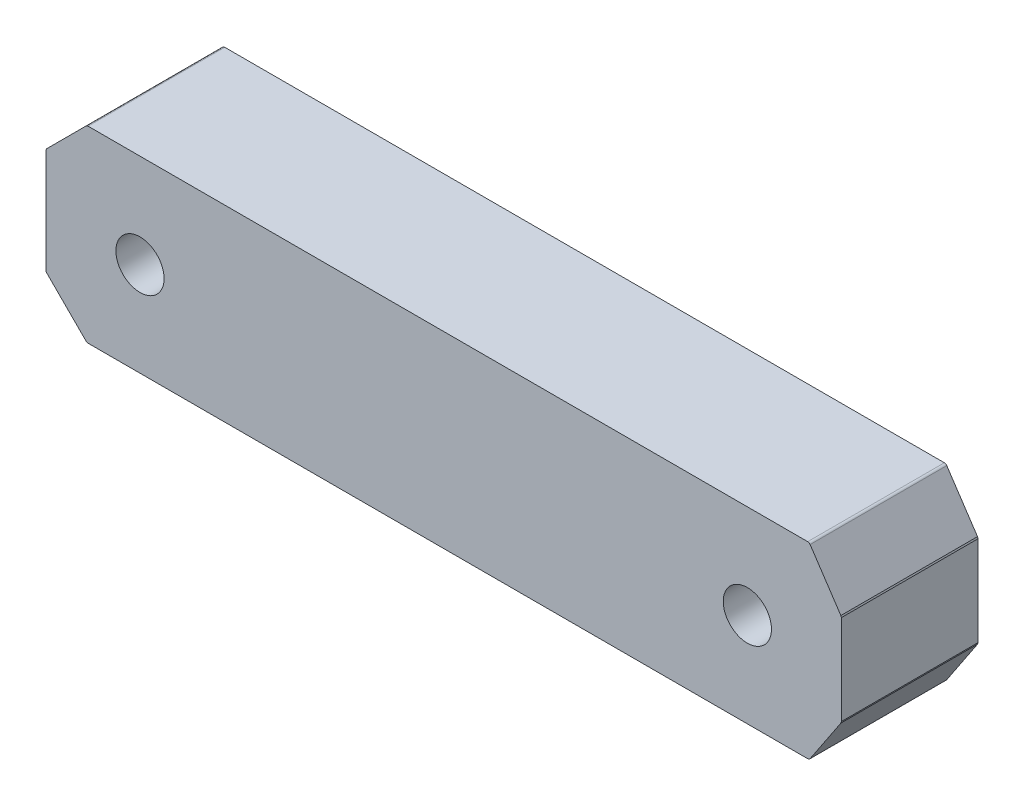
ISO-10303-21;
HEADER;
FILE_DESCRIPTION(('STEP AP214'),'2;1');
FILE_NAME('part.step','',(''),(''),'','','');
FILE_SCHEMA(('AUTOMOTIVE_DESIGN { 1 0 10303 214 1 1 1 1 }'));
ENDSEC;
DATA;
#1=APPLICATION_CONTEXT('core data for automotive mechanical design processes');
#2=APPLICATION_PROTOCOL_DEFINITION('international standard','automotive_design',2000,#1);
#3=PRODUCT_CONTEXT('',#1,'mechanical');
#4=PRODUCT('Part','Part','',(#3));
#5=PRODUCT_RELATED_PRODUCT_CATEGORY('part','',(#4));
#6=PRODUCT_DEFINITION_FORMATION('','',#4);
#7=PRODUCT_DEFINITION_CONTEXT('part definition',#1,'design');
#8=PRODUCT_DEFINITION('design','',#6,#7);
#9=PRODUCT_DEFINITION_SHAPE('','',#8);
#10=(LENGTH_UNIT() NAMED_UNIT(*) SI_UNIT(.MILLI.,.METRE.));
#11=(NAMED_UNIT(*) PLANE_ANGLE_UNIT() SI_UNIT($,.RADIAN.));
#12=(NAMED_UNIT(*) SI_UNIT($,.STERADIAN.) SOLID_ANGLE_UNIT());
#13=UNCERTAINTY_MEASURE_WITH_UNIT(LENGTH_MEASURE(1.E-05),#10,'distance_accuracy_value','');
#14=(GEOMETRIC_REPRESENTATION_CONTEXT(3) GLOBAL_UNCERTAINTY_ASSIGNED_CONTEXT((#13)) GLOBAL_UNIT_ASSIGNED_CONTEXT((#10,
#11,#12)) REPRESENTATION_CONTEXT('',''));
#15=CARTESIAN_POINT('',(0.,0.,0.));
#16=DIRECTION('',(0.,0.,1.));
#17=DIRECTION('',(1.,0.,0.));
#18=AXIS2_PLACEMENT_3D('',#15,#16,#17);
#19=CARTESIAN_POINT('',(-24.588730162779,-6.3,9.45));
#20=DIRECTION('',(0.,0.,1.));
#21=DIRECTION('',(1.,0.,0.));
#22=AXIS2_PLACEMENT_3D('',#19,#20,#21);
#23=PLANE('',#22);
#24=CARTESIAN_POINT('',(20.9999999999963,1.68441649517348E-12,9.45));
#25=DIRECTION('',(0.,0.,1.));
#26=DIRECTION('',(1.,0.,0.));
#27=AXIS2_PLACEMENT_3D('',#24,#25,#26);
#28=CIRCLE('',#27,1.666);
#29=CARTESIAN_POINT('',(22.6659999999963,1.68441649517348E-12,9.45));
#30=VERTEX_POINT('',#29);
#31=EDGE_CURVE('E182',#30,#30,#28,.T.);
#32=ORIENTED_EDGE('',*,*,#31,.F.);
#33=EDGE_LOOP('',(#32));
#34=FACE_BOUND('',#33,.T.);
#35=CARTESIAN_POINT('',(-24.588730162779,-6.3,9.45));
#36=DIRECTION('',(0.,0.,1.));
#37=DIRECTION('',(1.,0.,0.));
#38=AXIS2_PLACEMENT_3D('',#35,#36,#37);
#39=CIRCLE('',#38,0.200000000000001);
#40=CARTESIAN_POINT('',(-24.7301515190163,-6.44142135623731,9.45));
#41=VERTEX_POINT('',#40);
#42=CARTESIAN_POINT('',(-24.588730162779,-6.5,9.45));
#43=VERTEX_POINT('',#42);
#44=EDGE_CURVE('E209',#41,#43,#39,.T.);
#45=ORIENTED_EDGE('',*,*,#44,.T.);
#46=DIRECTION('',(1.,0.,0.));
#47=VECTOR('',#46,1.);
#48=CARTESIAN_POINT('',(-24.588730162779,-6.5,9.45));
#49=LINE('',#48,#47);
#50=CARTESIAN_POINT('',(25.174488320499,-6.5,9.45));
#51=VERTEX_POINT('',#50);
#52=EDGE_CURVE('E117',#43,#51,#49,.T.);
#53=ORIENTED_EDGE('',*,*,#52,.T.);
#54=CARTESIAN_POINT('',(25.174488320499,-6.3,9.45));
#55=DIRECTION('',(0.,0.,1.));
#56=DIRECTION('',(1.,0.,0.));
#57=AXIS2_PLACEMENT_3D('',#54,#55,#56);
#58=CIRCLE('',#57,0.2);
#59=CARTESIAN_POINT('',(25.3409096767364,-6.41092309132067,9.45));
#60=VERTEX_POINT('',#59);
#61=EDGE_CURVE('E248',#51,#60,#58,.T.);
#62=ORIENTED_EDGE('',*,*,#61,.T.);
#63=DIRECTION('',(0.554615456603367,0.832106781186549,0.));
#64=VECTOR('',#63,1.);
#65=CARTESIAN_POINT('',(27.4664213562376,-3.22195195655296,9.45));
#66=LINE('',#65,#64);
#67=CARTESIAN_POINT('',(27.4664213562376,-3.22195195655296,9.45));
#68=VERTEX_POINT('',#67);
#69=EDGE_CURVE('E267',#60,#68,#66,.T.);
#70=ORIENTED_EDGE('',*,*,#69,.T.);
#71=DIRECTION('',(0.289735412759155,0.957106781186552,0.));
#72=VECTOR('',#71,1.);
#73=CARTESIAN_POINT('',(27.4664213562376,-3.22195195655296,9.45));
#74=LINE('',#73,#72);
#75=CARTESIAN_POINT('',(27.5000000000002,-3.11102886523228,9.45));
#76=VERTEX_POINT('',#75);
#77=EDGE_CURVE('E264',#68,#76,#74,.T.);
#78=ORIENTED_EDGE('',*,*,#77,.T.);
#79=DIRECTION('',(0.,1.,0.));
#80=VECTOR('',#79,1.);
#81=CARTESIAN_POINT('',(27.5000000000002,3.11102886523228,9.45));
#82=LINE('',#81,#80);
#83=CARTESIAN_POINT('',(27.5000000000002,3.11102886523228,9.45));
#84=VERTEX_POINT('',#83);
#85=EDGE_CURVE('E266',#76,#84,#82,.T.);
#86=ORIENTED_EDGE('',*,*,#85,.T.);
#87=DIRECTION('',(-0.289735412759156,0.957106781186551,0.));
#88=VECTOR('',#87,1.);
#89=CARTESIAN_POINT('',(27.5000000000002,3.11102886523228,9.45));
#90=LINE('',#89,#88);
#91=CARTESIAN_POINT('',(27.4664213562376,3.22195195655296,9.45));
#92=VERTEX_POINT('',#91);
#93=EDGE_CURVE('E269',#84,#92,#90,.T.);
#94=ORIENTED_EDGE('',*,*,#93,.T.);
#95=DIRECTION('',(-0.554615456603367,0.832106781186549,0.));
#96=VECTOR('',#95,1.);
#97=CARTESIAN_POINT('',(25.3409096767364,6.41092309132067,9.45));
#98=LINE('',#97,#96);
#99=CARTESIAN_POINT('',(25.3409096767364,6.41092309132067,9.45));
#100=VERTEX_POINT('',#99);
#101=EDGE_CURVE('E275',#92,#100,#98,.T.);
#102=ORIENTED_EDGE('',*,*,#101,.T.);
#103=CARTESIAN_POINT('',(25.174488320499,6.3,9.45));
#104=DIRECTION('',(0.,0.,1.));
#105=DIRECTION('',(1.,0.,0.));
#106=AXIS2_PLACEMENT_3D('',#103,#104,#105);
#107=CIRCLE('',#106,0.2);
#108=CARTESIAN_POINT('',(25.174488320499,6.5,9.45));
#109=VERTEX_POINT('',#108);
#110=EDGE_CURVE('E277',#100,#109,#107,.T.);
#111=ORIENTED_EDGE('',*,*,#110,.T.);
#112=DIRECTION('',(-1.,0.,0.));
#113=VECTOR('',#112,1.);
#114=CARTESIAN_POINT('',(25.174488320499,6.5,9.45));
#115=LINE('',#114,#113);
#116=CARTESIAN_POINT('',(-24.588730162779,6.5,9.45));
#117=VERTEX_POINT('',#116);
#118=EDGE_CURVE('E279',#109,#117,#115,.T.);
#119=ORIENTED_EDGE('',*,*,#118,.T.);
#120=CARTESIAN_POINT('',(-24.588730162779,6.3,9.45));
#121=DIRECTION('',(0.,0.,1.));
#122=DIRECTION('',(1.,0.,0.));
#123=AXIS2_PLACEMENT_3D('',#120,#121,#122);
#124=CIRCLE('',#123,0.2);
#125=CARTESIAN_POINT('',(-24.7301515190163,6.44142135623731,9.45));
#126=VERTEX_POINT('',#125);
#127=EDGE_CURVE('E281',#117,#126,#124,.T.);
#128=ORIENTED_EDGE('',*,*,#127,.T.);
#129=DIRECTION('',(-0.707106781186545,-0.70710678118655,0.));
#130=VECTOR('',#129,1.);
#131=CARTESIAN_POINT('',(-27.4414213562371,3.73015151901648,9.45));
#132=LINE('',#131,#130);
#133=CARTESIAN_POINT('',(-27.4414213562371,3.73015151901648,9.45));
#134=VERTEX_POINT('',#133);
#135=EDGE_CURVE('E283',#126,#134,#132,.T.);
#136=ORIENTED_EDGE('',*,*,#135,.T.);
#137=CARTESIAN_POINT('',(-27.2999999999998,3.58873016277918,9.45));
#138=DIRECTION('',(0.,0.,1.));
#139=DIRECTION('',(1.,0.,0.));
#140=AXIS2_PLACEMENT_3D('',#137,#138,#139);
#141=CIRCLE('',#140,0.199999999999999);
#142=CARTESIAN_POINT('',(-27.4999999999998,3.58873016277918,9.45));
#143=VERTEX_POINT('',#142);
#144=EDGE_CURVE('E160',#134,#143,#141,.T.);
#145=ORIENTED_EDGE('',*,*,#144,.T.);
#146=DIRECTION('',(0.,-1.,0.));
#147=VECTOR('',#146,1.);
#148=CARTESIAN_POINT('',(-27.4999999999998,-3.58873016277918,9.45));
#149=LINE('',#148,#147);
#150=CARTESIAN_POINT('',(-27.4999999999998,-3.58873016277918,9.45));
#151=VERTEX_POINT('',#150);
#152=EDGE_CURVE('E154',#143,#151,#149,.T.);
#153=ORIENTED_EDGE('',*,*,#152,.T.);
#154=CARTESIAN_POINT('',(-27.2999999999998,-3.58873016277918,9.45));
#155=DIRECTION('',(0.,0.,1.));
#156=DIRECTION('',(1.,0.,0.));
#157=AXIS2_PLACEMENT_3D('',#154,#155,#156);
#158=CIRCLE('',#157,0.199999999999999);
#159=CARTESIAN_POINT('',(-27.4414213562371,-3.73015151901649,9.45));
#160=VERTEX_POINT('',#159);
#161=EDGE_CURVE('E158',#151,#160,#158,.T.);
#162=ORIENTED_EDGE('',*,*,#161,.T.);
#163=DIRECTION('',(0.707106781186545,-0.70710678118655,0.));
#164=VECTOR('',#163,1.);
#165=CARTESIAN_POINT('',(-24.7301515190163,-6.44142135623731,9.45));
#166=LINE('',#165,#164);
#167=EDGE_CURVE('E50',#160,#41,#166,.T.);
#168=ORIENTED_EDGE('',*,*,#167,.T.);
#169=EDGE_LOOP('',(#45,#53,#62,#70,#78,#86,#94,#102,#111,#119,#128,#136,#145,#153,#162,#168));
#170=FACE_BOUND('',#169,.T.);
#171=CARTESIAN_POINT('',(-21.0000000000037,1.18481613409216E-12,9.45));
#172=DIRECTION('',(0.,0.,1.));
#173=DIRECTION('',(1.,0.,0.));
#174=AXIS2_PLACEMENT_3D('',#171,#172,#173);
#175=CIRCLE('',#174,1.66600000000001);
#176=CARTESIAN_POINT('',(-19.3340000000037,1.18481613409216E-12,9.45));
#177=VERTEX_POINT('',#176);
#178=EDGE_CURVE('E325',#177,#177,#175,.T.);
#179=ORIENTED_EDGE('',*,*,#178,.F.);
#180=EDGE_LOOP('',(#179));
#181=FACE_BOUND('',#180,.T.);
#182=ADVANCED_FACE('F33',(#34,#170,#181),#23,.T.);
#183=CARTESIAN_POINT('',(-24.588730162779,-6.3,0.));
#184=DIRECTION('',(0.,0.,1.));
#185=DIRECTION('',(1.,0.,0.));
#186=AXIS2_PLACEMENT_3D('',#183,#184,#185);
#187=PLANE('',#186);
#188=CARTESIAN_POINT('',(-24.588730162779,-6.3,0.));
#189=DIRECTION('',(0.,0.,1.));
#190=DIRECTION('',(1.,0.,0.));
#191=AXIS2_PLACEMENT_3D('',#188,#189,#190);
#192=CIRCLE('',#191,0.200000000000001);
#193=CARTESIAN_POINT('',(-24.7301515190163,-6.44142135623731,0.));
#194=VERTEX_POINT('',#193);
#195=CARTESIAN_POINT('',(-24.588730162779,-6.5,0.));
#196=VERTEX_POINT('',#195);
#197=EDGE_CURVE('E178',#194,#196,#192,.T.);
#198=ORIENTED_EDGE('',*,*,#197,.F.);
#199=DIRECTION('',(0.707106781186545,-0.70710678118655,0.));
#200=VECTOR('',#199,1.);
#201=CARTESIAN_POINT('',(-24.7301515190163,-6.44142135623731,0.));
#202=LINE('',#201,#200);
#203=CARTESIAN_POINT('',(-27.4414213562371,-3.73015151901649,0.));
#204=VERTEX_POINT('',#203);
#205=EDGE_CURVE('E109',#204,#194,#202,.T.);
#206=ORIENTED_EDGE('',*,*,#205,.F.);
#207=CARTESIAN_POINT('',(-27.2999999999998,-3.58873016277918,0.));
#208=DIRECTION('',(0.,0.,1.));
#209=DIRECTION('',(1.,0.,0.));
#210=AXIS2_PLACEMENT_3D('',#207,#208,#209);
#211=CIRCLE('',#210,0.199999999999999);
#212=CARTESIAN_POINT('',(-27.4999999999998,-3.58873016277918,0.));
#213=VERTEX_POINT('',#212);
#214=EDGE_CURVE('E103',#213,#204,#211,.T.);
#215=ORIENTED_EDGE('',*,*,#214,.F.);
#216=DIRECTION('',(0.,-1.,0.));
#217=VECTOR('',#216,1.);
#218=CARTESIAN_POINT('',(-27.4999999999998,-3.58873016277918,0.));
#219=LINE('',#218,#217);
#220=CARTESIAN_POINT('',(-27.4999999999998,3.58873016277918,0.));
#221=VERTEX_POINT('',#220);
#222=EDGE_CURVE('E168',#221,#213,#219,.T.);
#223=ORIENTED_EDGE('',*,*,#222,.F.);
#224=CARTESIAN_POINT('',(-27.2999999999998,3.58873016277918,0.));
#225=DIRECTION('',(0.,0.,1.));
#226=DIRECTION('',(1.,0.,0.));
#227=AXIS2_PLACEMENT_3D('',#224,#225,#226);
#228=CIRCLE('',#227,0.199999999999999);
#229=CARTESIAN_POINT('',(-27.4414213562371,3.73015151901648,0.));
#230=VERTEX_POINT('',#229);
#231=EDGE_CURVE('E204',#230,#221,#228,.T.);
#232=ORIENTED_EDGE('',*,*,#231,.F.);
#233=DIRECTION('',(-0.707106781186545,-0.70710678118655,0.));
#234=VECTOR('',#233,1.);
#235=CARTESIAN_POINT('',(-27.4414213562371,3.73015151901648,0.));
#236=LINE('',#235,#234);
#237=CARTESIAN_POINT('',(-24.7301515190163,6.44142135623731,0.));
#238=VERTEX_POINT('',#237);
#239=EDGE_CURVE('E202',#238,#230,#236,.T.);
#240=ORIENTED_EDGE('',*,*,#239,.F.);
#241=CARTESIAN_POINT('',(-24.588730162779,6.3,0.));
#242=DIRECTION('',(0.,0.,1.));
#243=DIRECTION('',(1.,0.,0.));
#244=AXIS2_PLACEMENT_3D('',#241,#242,#243);
#245=CIRCLE('',#244,0.2);
#246=CARTESIAN_POINT('',(-24.588730162779,6.5,0.));
#247=VERTEX_POINT('',#246);
#248=EDGE_CURVE('E200',#247,#238,#245,.T.);
#249=ORIENTED_EDGE('',*,*,#248,.F.);
#250=DIRECTION('',(-1.,0.,0.));
#251=VECTOR('',#250,1.);
#252=CARTESIAN_POINT('',(25.174488320499,6.5,0.));
#253=LINE('',#252,#251);
#254=CARTESIAN_POINT('',(25.174488320499,6.5,0.));
#255=VERTEX_POINT('',#254);
#256=EDGE_CURVE('E198',#255,#247,#253,.T.);
#257=ORIENTED_EDGE('',*,*,#256,.F.);
#258=CARTESIAN_POINT('',(25.174488320499,6.3,0.));
#259=DIRECTION('',(0.,0.,1.));
#260=DIRECTION('',(1.,0.,0.));
#261=AXIS2_PLACEMENT_3D('',#258,#259,#260);
#262=CIRCLE('',#261,0.2);
#263=CARTESIAN_POINT('',(25.3409096767364,6.41092309132067,0.));
#264=VERTEX_POINT('',#263);
#265=EDGE_CURVE('E196',#264,#255,#262,.T.);
#266=ORIENTED_EDGE('',*,*,#265,.F.);
#267=DIRECTION('',(-0.554615456603367,0.832106781186549,0.));
#268=VECTOR('',#267,1.);
#269=CARTESIAN_POINT('',(25.3409096767364,6.41092309132067,0.));
#270=LINE('',#269,#268);
#271=CARTESIAN_POINT('',(27.4664213562376,3.22195195655296,0.));
#272=VERTEX_POINT('',#271);
#273=EDGE_CURVE('E194',#272,#264,#270,.T.);
#274=ORIENTED_EDGE('',*,*,#273,.F.);
#275=DIRECTION('',(-0.289735412759156,0.957106781186551,0.));
#276=VECTOR('',#275,1.);
#277=CARTESIAN_POINT('',(27.5000000000002,3.11102886523228,0.));
#278=LINE('',#277,#276);
#279=CARTESIAN_POINT('',(27.5000000000002,3.11102886523228,0.));
#280=VERTEX_POINT('',#279);
#281=EDGE_CURVE('E192',#280,#272,#278,.T.);
#282=ORIENTED_EDGE('',*,*,#281,.F.);
#283=DIRECTION('',(0.,1.,0.));
#284=VECTOR('',#283,1.);
#285=CARTESIAN_POINT('',(27.5000000000002,3.11102886523228,0.));
#286=LINE('',#285,#284);
#287=CARTESIAN_POINT('',(27.5000000000002,-3.11102886523228,0.));
#288=VERTEX_POINT('',#287);
#289=EDGE_CURVE('E190',#288,#280,#286,.T.);
#290=ORIENTED_EDGE('',*,*,#289,.F.);
#291=DIRECTION('',(0.289735412759155,0.957106781186552,0.));
#292=VECTOR('',#291,1.);
#293=CARTESIAN_POINT('',(27.4664213562376,-3.22195195655296,0.));
#294=LINE('',#293,#292);
#295=CARTESIAN_POINT('',(27.4664213562376,-3.22195195655296,0.));
#296=VERTEX_POINT('',#295);
#297=EDGE_CURVE('E188',#296,#288,#294,.T.);
#298=ORIENTED_EDGE('',*,*,#297,.F.);
#299=DIRECTION('',(0.554615456603367,0.832106781186549,0.));
#300=VECTOR('',#299,1.);
#301=CARTESIAN_POINT('',(27.4664213562376,-3.22195195655296,0.));
#302=LINE('',#301,#300);
#303=CARTESIAN_POINT('',(25.3409096767364,-6.41092309132067,0.));
#304=VERTEX_POINT('',#303);
#305=EDGE_CURVE('E186',#304,#296,#302,.T.);
#306=ORIENTED_EDGE('',*,*,#305,.F.);
#307=CARTESIAN_POINT('',(25.174488320499,-6.3,0.));
#308=DIRECTION('',(0.,0.,1.));
#309=DIRECTION('',(1.,0.,0.));
#310=AXIS2_PLACEMENT_3D('',#307,#308,#309);
#311=CIRCLE('',#310,0.2);
#312=CARTESIAN_POINT('',(25.174488320499,-6.5,0.));
#313=VERTEX_POINT('',#312);
#314=EDGE_CURVE('E184',#313,#304,#311,.T.);
#315=ORIENTED_EDGE('',*,*,#314,.F.);
#316=DIRECTION('',(1.,0.,0.));
#317=VECTOR('',#316,1.);
#318=CARTESIAN_POINT('',(-24.588730162779,-6.5,0.));
#319=LINE('',#318,#317);
#320=EDGE_CURVE('E181',#196,#313,#319,.T.);
#321=ORIENTED_EDGE('',*,*,#320,.F.);
#322=EDGE_LOOP('',(#198,#206,#215,#223,#232,#240,#249,#257,#266,#274,#282,#290,#298,#306,#315,#321));
#323=FACE_BOUND('',#322,.T.);
#324=CARTESIAN_POINT('',(20.9999999999963,1.68441649517348E-12,0.));
#325=DIRECTION('',(0.,0.,1.));
#326=DIRECTION('',(1.,0.,0.));
#327=AXIS2_PLACEMENT_3D('',#324,#325,#326);
#328=CIRCLE('',#327,1.666);
#329=CARTESIAN_POINT('',(22.6659999999963,1.68441649517348E-12,0.));
#330=VERTEX_POINT('',#329);
#331=EDGE_CURVE('E331',#330,#330,#328,.T.);
#332=ORIENTED_EDGE('',*,*,#331,.T.);
#333=EDGE_LOOP('',(#332));
#334=FACE_BOUND('',#333,.T.);
#335=CARTESIAN_POINT('',(-21.0000000000037,1.18481613409216E-12,0.));
#336=DIRECTION('',(0.,0.,1.));
#337=DIRECTION('',(1.,0.,0.));
#338=AXIS2_PLACEMENT_3D('',#335,#336,#337);
#339=CIRCLE('',#338,1.66600000000001);
#340=CARTESIAN_POINT('',(-19.3340000000037,1.18481613409216E-12,0.));
#341=VERTEX_POINT('',#340);
#342=EDGE_CURVE('E328',#341,#341,#339,.T.);
#343=ORIENTED_EDGE('',*,*,#342,.T.);
#344=EDGE_LOOP('',(#343));
#345=FACE_BOUND('',#344,.T.);
#346=ADVANCED_FACE('F252',(#323,#334,#345),#187,.F.);
#347=CARTESIAN_POINT('',(-24.588730162779,-6.3,9.45));
#348=DIRECTION('',(0.,0.,-1.));
#349=DIRECTION('',(-1.,0.,0.));
#350=AXIS2_PLACEMENT_3D('',#347,#348,#349);
#351=CYLINDRICAL_SURFACE('',#350,0.200000000000001);
#352=ORIENTED_EDGE('',*,*,#197,.T.);
#353=DIRECTION('',(0.,0.,-1.));
#354=VECTOR('',#353,1.);
#355=CARTESIAN_POINT('',(-24.588730162779,-6.5,9.45));
#356=LINE('',#355,#354);
#357=EDGE_CURVE('E11',#43,#196,#356,.T.);
#358=ORIENTED_EDGE('',*,*,#357,.F.);
#359=ORIENTED_EDGE('',*,*,#44,.F.);
#360=DIRECTION('',(0.,0.,-1.));
#361=VECTOR('',#360,1.);
#362=CARTESIAN_POINT('',(-24.7301515190163,-6.44142135623731,9.45));
#363=LINE('',#362,#361);
#364=EDGE_CURVE('E174',#41,#194,#363,.T.);
#365=ORIENTED_EDGE('',*,*,#364,.T.);
#366=EDGE_LOOP('',(#352,#358,#359,#365));
#367=FACE_BOUND('',#366,.T.);
#368=ADVANCED_FACE('F35',(#367),#351,.T.);
#369=CARTESIAN_POINT('',(-24.588730162779,-6.5,9.45));
#370=DIRECTION('',(0.,1.,0.));
#371=DIRECTION('',(0.,0.,1.));
#372=AXIS2_PLACEMENT_3D('',#369,#370,#371);
#373=PLANE('',#372);
#374=ORIENTED_EDGE('',*,*,#320,.T.);
#375=DIRECTION('',(0.,0.,-1.));
#376=VECTOR('',#375,1.);
#377=CARTESIAN_POINT('',(25.174488320499,-6.5,9.45));
#378=LINE('',#377,#376);
#379=EDGE_CURVE('E42',#51,#313,#378,.T.);
#380=ORIENTED_EDGE('',*,*,#379,.F.);
#381=ORIENTED_EDGE('',*,*,#52,.F.);
#382=ORIENTED_EDGE('',*,*,#357,.T.);
#383=EDGE_LOOP('',(#374,#380,#381,#382));
#384=FACE_BOUND('',#383,.T.);
#385=ADVANCED_FACE('F464',(#384),#373,.F.);
#386=CARTESIAN_POINT('',(25.174488320499,-6.3,9.45));
#387=DIRECTION('',(0.,0.,-1.));
#388=DIRECTION('',(-1.,0.,0.));
#389=AXIS2_PLACEMENT_3D('',#386,#387,#388);
#390=CYLINDRICAL_SURFACE('',#389,0.2);
#391=ORIENTED_EDGE('',*,*,#314,.T.);
#392=DIRECTION('',(0.,0.,-1.));
#393=VECTOR('',#392,1.);
#394=CARTESIAN_POINT('',(25.3409096767364,-6.41092309132067,9.45));
#395=LINE('',#394,#393);
#396=EDGE_CURVE('E240',#60,#304,#395,.T.);
#397=ORIENTED_EDGE('',*,*,#396,.F.);
#398=ORIENTED_EDGE('',*,*,#61,.F.);
#399=ORIENTED_EDGE('',*,*,#379,.T.);
#400=EDGE_LOOP('',(#391,#397,#398,#399));
#401=FACE_BOUND('',#400,.T.);
#402=ADVANCED_FACE('F246',(#401),#390,.T.);
#403=CARTESIAN_POINT('',(27.4664213562376,-3.22195195655296,9.45));
#404=DIRECTION('',(-0.832106781186549,0.554615456603367,0.));
#405=DIRECTION('',(-0.554615456603367,-0.832106781186549,0.));
#406=AXIS2_PLACEMENT_3D('',#403,#404,#405);
#407=PLANE('',#406);
#408=ORIENTED_EDGE('',*,*,#305,.T.);
#409=DIRECTION('',(0.,0.,-1.));
#410=VECTOR('',#409,1.);
#411=CARTESIAN_POINT('',(27.4664213562376,-3.22195195655296,9.45));
#412=LINE('',#411,#410);
#413=EDGE_CURVE('E237',#68,#296,#412,.T.);
#414=ORIENTED_EDGE('',*,*,#413,.F.);
#415=ORIENTED_EDGE('',*,*,#69,.F.);
#416=ORIENTED_EDGE('',*,*,#396,.T.);
#417=EDGE_LOOP('',(#408,#414,#415,#416));
#418=FACE_BOUND('',#417,.T.);
#419=ADVANCED_FACE('F258',(#418),#407,.F.);
#420=CARTESIAN_POINT('',(27.4664213562376,-3.22195195655296,9.45));
#421=DIRECTION('',(-0.957106781186552,0.289735412759155,0.));
#422=DIRECTION('',(-0.289735412759155,-0.957106781186552,0.));
#423=AXIS2_PLACEMENT_3D('',#420,#421,#422);
#424=PLANE('',#423);
#425=ORIENTED_EDGE('',*,*,#297,.T.);
#426=DIRECTION('',(0.,0.,-1.));
#427=VECTOR('',#426,1.);
#428=CARTESIAN_POINT('',(27.5000000000002,-3.11102886523228,9.45));
#429=LINE('',#428,#427);
#430=EDGE_CURVE('E234',#76,#288,#429,.T.);
#431=ORIENTED_EDGE('',*,*,#430,.F.);
#432=ORIENTED_EDGE('',*,*,#77,.F.);
#433=ORIENTED_EDGE('',*,*,#413,.T.);
#434=EDGE_LOOP('',(#425,#431,#432,#433));
#435=FACE_BOUND('',#434,.T.);
#436=ADVANCED_FACE('F262',(#435),#424,.F.);
#437=CARTESIAN_POINT('',(27.5000000000002,3.11102886523228,9.45));
#438=DIRECTION('',(-1.,0.,0.));
#439=DIRECTION('',(0.,0.,1.));
#440=AXIS2_PLACEMENT_3D('',#437,#438,#439);
#441=PLANE('',#440);
#442=ORIENTED_EDGE('',*,*,#289,.T.);
#443=DIRECTION('',(0.,0.,-1.));
#444=VECTOR('',#443,1.);
#445=CARTESIAN_POINT('',(27.5000000000002,3.11102886523228,9.45));
#446=LINE('',#445,#444);
#447=EDGE_CURVE('E231',#84,#280,#446,.T.);
#448=ORIENTED_EDGE('',*,*,#447,.F.);
#449=ORIENTED_EDGE('',*,*,#85,.F.);
#450=ORIENTED_EDGE('',*,*,#430,.T.);
#451=EDGE_LOOP('',(#442,#448,#449,#450));
#452=FACE_BOUND('',#451,.T.);
#453=ADVANCED_FACE('F429',(#452),#441,.F.);
#454=CARTESIAN_POINT('',(27.5000000000002,3.11102886523228,9.45));
#455=DIRECTION('',(-0.957106781186552,-0.289735412759156,0.));
#456=DIRECTION('',(0.289735412759156,-0.957106781186552,0.));
#457=AXIS2_PLACEMENT_3D('',#454,#455,#456);
#458=PLANE('',#457);
#459=ORIENTED_EDGE('',*,*,#281,.T.);
#460=DIRECTION('',(0.,0.,-1.));
#461=VECTOR('',#460,1.);
#462=CARTESIAN_POINT('',(27.4664213562376,3.22195195655296,9.45));
#463=LINE('',#462,#461);
#464=EDGE_CURVE('E228',#92,#272,#463,.T.);
#465=ORIENTED_EDGE('',*,*,#464,.F.);
#466=ORIENTED_EDGE('',*,*,#93,.F.);
#467=ORIENTED_EDGE('',*,*,#447,.T.);
#468=EDGE_LOOP('',(#459,#465,#466,#467));
#469=FACE_BOUND('',#468,.T.);
#470=ADVANCED_FACE('F419',(#469),#458,.F.);
#471=CARTESIAN_POINT('',(25.3409096767364,6.41092309132067,9.45));
#472=DIRECTION('',(-0.832106781186549,-0.554615456603367,0.));
#473=DIRECTION('',(0.554615456603367,-0.832106781186549,0.));
#474=AXIS2_PLACEMENT_3D('',#471,#472,#473);
#475=PLANE('',#474);
#476=ORIENTED_EDGE('',*,*,#273,.T.);
#477=DIRECTION('',(0.,0.,-1.));
#478=VECTOR('',#477,1.);
#479=CARTESIAN_POINT('',(25.3409096767364,6.41092309132067,9.45));
#480=LINE('',#479,#478);
#481=EDGE_CURVE('E225',#100,#264,#480,.T.);
#482=ORIENTED_EDGE('',*,*,#481,.F.);
#483=ORIENTED_EDGE('',*,*,#101,.F.);
#484=ORIENTED_EDGE('',*,*,#464,.T.);
#485=EDGE_LOOP('',(#476,#482,#483,#484));
#486=FACE_BOUND('',#485,.T.);
#487=ADVANCED_FACE('F409',(#486),#475,.F.);
#488=CARTESIAN_POINT('',(25.174488320499,6.3,9.45));
#489=DIRECTION('',(0.,0.,-1.));
#490=DIRECTION('',(-1.,0.,0.));
#491=AXIS2_PLACEMENT_3D('',#488,#489,#490);
#492=CYLINDRICAL_SURFACE('',#491,0.2);
#493=ORIENTED_EDGE('',*,*,#265,.T.);
#494=DIRECTION('',(0.,0.,-1.));
#495=VECTOR('',#494,1.);
#496=CARTESIAN_POINT('',(25.174488320499,6.5,9.45));
#497=LINE('',#496,#495);
#498=EDGE_CURVE('E222',#109,#255,#497,.T.);
#499=ORIENTED_EDGE('',*,*,#498,.F.);
#500=ORIENTED_EDGE('',*,*,#110,.F.);
#501=ORIENTED_EDGE('',*,*,#481,.T.);
#502=EDGE_LOOP('',(#493,#499,#500,#501));
#503=FACE_BOUND('',#502,.T.);
#504=ADVANCED_FACE('F399',(#503),#492,.T.);
#505=CARTESIAN_POINT('',(25.174488320499,6.5,9.45));
#506=DIRECTION('',(0.,-1.,0.));
#507=DIRECTION('',(0.,0.,-1.));
#508=AXIS2_PLACEMENT_3D('',#505,#506,#507);
#509=PLANE('',#508);
#510=ORIENTED_EDGE('',*,*,#256,.T.);
#511=DIRECTION('',(0.,0.,-1.));
#512=VECTOR('',#511,1.);
#513=CARTESIAN_POINT('',(-24.588730162779,6.5,9.45));
#514=LINE('',#513,#512);
#515=EDGE_CURVE('E219',#117,#247,#514,.T.);
#516=ORIENTED_EDGE('',*,*,#515,.F.);
#517=ORIENTED_EDGE('',*,*,#118,.F.);
#518=ORIENTED_EDGE('',*,*,#498,.T.);
#519=EDGE_LOOP('',(#510,#516,#517,#518));
#520=FACE_BOUND('',#519,.T.);
#521=ADVANCED_FACE('F389',(#520),#509,.F.);
#522=CARTESIAN_POINT('',(-24.588730162779,6.3,9.45));
#523=DIRECTION('',(0.,0.,-1.));
#524=DIRECTION('',(-1.,0.,0.));
#525=AXIS2_PLACEMENT_3D('',#522,#523,#524);
#526=CYLINDRICAL_SURFACE('',#525,0.2);
#527=ORIENTED_EDGE('',*,*,#248,.T.);
#528=DIRECTION('',(0.,0.,-1.));
#529=VECTOR('',#528,1.);
#530=CARTESIAN_POINT('',(-24.7301515190163,6.44142135623731,9.45));
#531=LINE('',#530,#529);
#532=EDGE_CURVE('E216',#126,#238,#531,.T.);
#533=ORIENTED_EDGE('',*,*,#532,.F.);
#534=ORIENTED_EDGE('',*,*,#127,.F.);
#535=ORIENTED_EDGE('',*,*,#515,.T.);
#536=EDGE_LOOP('',(#527,#533,#534,#535));
#537=FACE_BOUND('',#536,.T.);
#538=ADVANCED_FACE('F380',(#537),#526,.T.);
#539=CARTESIAN_POINT('',(-27.4414213562371,3.73015151901648,9.45));
#540=DIRECTION('',(0.70710678118655,-0.707106781186545,0.));
#541=DIRECTION('',(0.707106781186545,0.70710678118655,0.));
#542=AXIS2_PLACEMENT_3D('',#539,#540,#541);
#543=PLANE('',#542);
#544=ORIENTED_EDGE('',*,*,#239,.T.);
#545=DIRECTION('',(0.,0.,-1.));
#546=VECTOR('',#545,1.);
#547=CARTESIAN_POINT('',(-27.4414213562371,3.73015151901648,9.45));
#548=LINE('',#547,#546);
#549=EDGE_CURVE('E213',#134,#230,#548,.T.);
#550=ORIENTED_EDGE('',*,*,#549,.F.);
#551=ORIENTED_EDGE('',*,*,#135,.F.);
#552=ORIENTED_EDGE('',*,*,#532,.T.);
#553=EDGE_LOOP('',(#544,#550,#551,#552));
#554=FACE_BOUND('',#553,.T.);
#555=ADVANCED_FACE('F289',(#554),#543,.F.);
#556=CARTESIAN_POINT('',(-27.2999999999998,3.58873016277918,9.45));
#557=DIRECTION('',(0.,0.,-1.));
#558=DIRECTION('',(-1.,0.,0.));
#559=AXIS2_PLACEMENT_3D('',#556,#557,#558);
#560=CYLINDRICAL_SURFACE('',#559,0.199999999999999);
#561=ORIENTED_EDGE('',*,*,#231,.T.);
#562=DIRECTION('',(0.,0.,-1.));
#563=VECTOR('',#562,1.);
#564=CARTESIAN_POINT('',(-27.4999999999998,3.58873016277918,9.45));
#565=LINE('',#564,#563);
#566=EDGE_CURVE('E169',#143,#221,#565,.T.);
#567=ORIENTED_EDGE('',*,*,#566,.F.);
#568=ORIENTED_EDGE('',*,*,#144,.F.);
#569=ORIENTED_EDGE('',*,*,#549,.T.);
#570=EDGE_LOOP('',(#561,#567,#568,#569));
#571=FACE_BOUND('',#570,.T.);
#572=ADVANCED_FACE('F293',(#571),#560,.T.);
#573=CARTESIAN_POINT('',(-27.4999999999998,-3.58873016277918,9.45));
#574=DIRECTION('',(1.,0.,0.));
#575=DIRECTION('',(0.,0.,-1.));
#576=AXIS2_PLACEMENT_3D('',#573,#574,#575);
#577=PLANE('',#576);
#578=ORIENTED_EDGE('',*,*,#222,.T.);
#579=DIRECTION('',(0.,0.,-1.));
#580=VECTOR('',#579,1.);
#581=CARTESIAN_POINT('',(-27.4999999999998,-3.58873016277918,9.45));
#582=LINE('',#581,#580);
#583=EDGE_CURVE('E165',#151,#213,#582,.T.);
#584=ORIENTED_EDGE('',*,*,#583,.F.);
#585=ORIENTED_EDGE('',*,*,#152,.F.);
#586=ORIENTED_EDGE('',*,*,#566,.T.);
#587=EDGE_LOOP('',(#578,#584,#585,#586));
#588=FACE_BOUND('',#587,.T.);
#589=ADVANCED_FACE('F166',(#588),#577,.F.);
#590=CARTESIAN_POINT('',(-27.2999999999998,-3.58873016277918,9.45));
#591=DIRECTION('',(0.,0.,-1.));
#592=DIRECTION('',(-1.,0.,0.));
#593=AXIS2_PLACEMENT_3D('',#590,#591,#592);
#594=CYLINDRICAL_SURFACE('',#593,0.199999999999999);
#595=ORIENTED_EDGE('',*,*,#214,.T.);
#596=DIRECTION('',(0.,0.,-1.));
#597=VECTOR('',#596,1.);
#598=CARTESIAN_POINT('',(-27.4414213562371,-3.73015151901649,9.45));
#599=LINE('',#598,#597);
#600=EDGE_CURVE('E170',#160,#204,#599,.T.);
#601=ORIENTED_EDGE('',*,*,#600,.F.);
#602=ORIENTED_EDGE('',*,*,#161,.F.);
#603=ORIENTED_EDGE('',*,*,#583,.T.);
#604=EDGE_LOOP('',(#595,#601,#602,#603));
#605=FACE_BOUND('',#604,.T.);
#606=ADVANCED_FACE('F172',(#605),#594,.T.);
#607=CARTESIAN_POINT('',(-24.7301515190163,-6.44142135623731,9.45));
#608=DIRECTION('',(0.70710678118655,0.707106781186545,0.));
#609=DIRECTION('',(-0.707106781186545,0.70710678118655,0.));
#610=AXIS2_PLACEMENT_3D('',#607,#608,#609);
#611=PLANE('',#610);
#612=ORIENTED_EDGE('',*,*,#205,.T.);
#613=ORIENTED_EDGE('',*,*,#364,.F.);
#614=ORIENTED_EDGE('',*,*,#167,.F.);
#615=ORIENTED_EDGE('',*,*,#600,.T.);
#616=EDGE_LOOP('',(#612,#613,#614,#615));
#617=FACE_BOUND('',#616,.T.);
#618=ADVANCED_FACE('F297',(#617),#611,.F.);
#619=CARTESIAN_POINT('',(20.9999999999963,1.68441649517348E-12,9.45));
#620=DIRECTION('',(0.,0.,-1.));
#621=DIRECTION('',(-1.,0.,0.));
#622=AXIS2_PLACEMENT_3D('',#619,#620,#621);
#623=CYLINDRICAL_SURFACE('',#622,1.666);
#624=ORIENTED_EDGE('',*,*,#31,.T.);
#625=EDGE_LOOP('',(#624));
#626=FACE_BOUND('',#625,.T.);
#627=ORIENTED_EDGE('',*,*,#331,.F.);
#628=EDGE_LOOP('',(#627));
#629=FACE_BOUND('',#628,.T.);
#630=ADVANCED_FACE('F299',(#626,#629),#623,.F.);
#631=CARTESIAN_POINT('',(-21.0000000000037,1.18481613409216E-12,9.45));
#632=DIRECTION('',(0.,0.,-1.));
#633=DIRECTION('',(-1.,0.,0.));
#634=AXIS2_PLACEMENT_3D('',#631,#632,#633);
#635=CYLINDRICAL_SURFACE('',#634,1.66600000000001);
#636=ORIENTED_EDGE('',*,*,#178,.T.);
#637=EDGE_LOOP('',(#636));
#638=FACE_BOUND('',#637,.T.);
#639=ORIENTED_EDGE('',*,*,#342,.F.);
#640=EDGE_LOOP('',(#639));
#641=FACE_BOUND('',#640,.T.);
#642=ADVANCED_FACE('F305',(#638,#641),#635,.F.);
#643=CLOSED_SHELL('',(#182,#346,#368,#385,#402,#419,#436,#453,#470,#487,#504,#521,#538,#555,
#572,#589,#606,#618,#630,#642));
#644=MANIFOLD_SOLID_BREP('B2',#643);
#645=ADVANCED_BREP_SHAPE_REPRESENTATION('',(#18,#644),#14);
#646=SHAPE_DEFINITION_REPRESENTATION(#9,#645);
ENDSEC;
END-ISO-10303-21;
